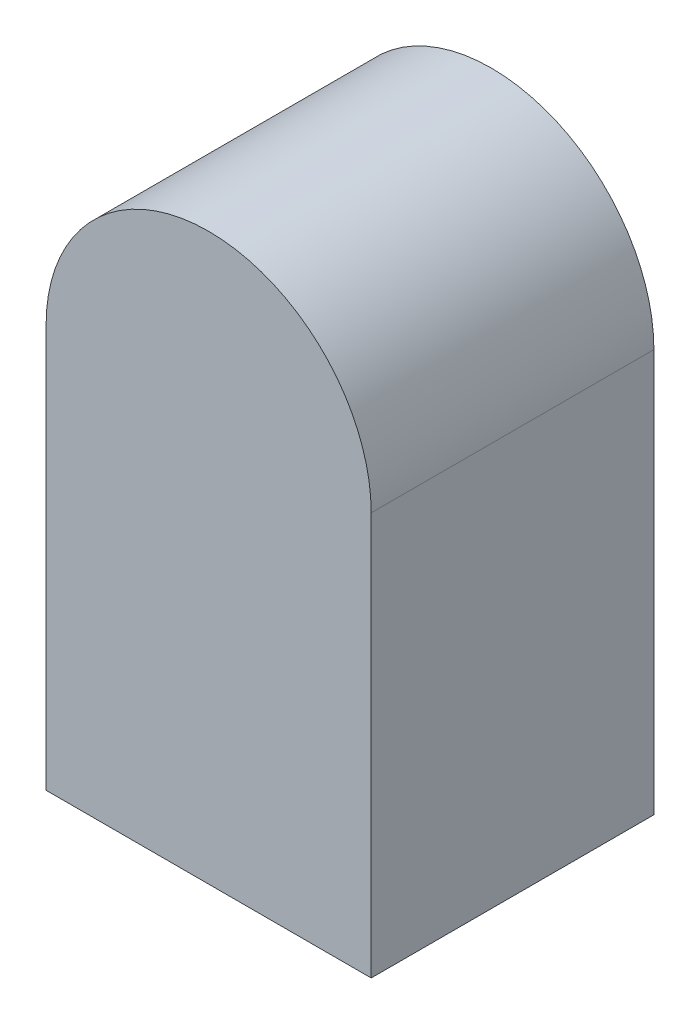
ISO-10303-21;
HEADER;
FILE_DESCRIPTION(('STEP AP214'),'2;1');
FILE_NAME('part.step','',(''),(''),'','','');
FILE_SCHEMA(('AUTOMOTIVE_DESIGN { 1 0 10303 214 1 1 1 1 }'));
ENDSEC;
DATA;
#1=APPLICATION_CONTEXT('core data for automotive mechanical design processes');
#2=APPLICATION_PROTOCOL_DEFINITION('international standard','automotive_design',2000,#1);
#3=PRODUCT_CONTEXT('',#1,'mechanical');
#4=PRODUCT('Part','Part','',(#3));
#5=PRODUCT_RELATED_PRODUCT_CATEGORY('part','',(#4));
#6=PRODUCT_DEFINITION_FORMATION('','',#4);
#7=PRODUCT_DEFINITION_CONTEXT('part definition',#1,'design');
#8=PRODUCT_DEFINITION('design','',#6,#7);
#9=PRODUCT_DEFINITION_SHAPE('','',#8);
#10=(LENGTH_UNIT() NAMED_UNIT(*) SI_UNIT(.MILLI.,.METRE.));
#11=(NAMED_UNIT(*) PLANE_ANGLE_UNIT() SI_UNIT($,.RADIAN.));
#12=(NAMED_UNIT(*) SI_UNIT($,.STERADIAN.) SOLID_ANGLE_UNIT());
#13=UNCERTAINTY_MEASURE_WITH_UNIT(LENGTH_MEASURE(1.E-05),#10,'distance_accuracy_value','');
#14=(GEOMETRIC_REPRESENTATION_CONTEXT(3) GLOBAL_UNCERTAINTY_ASSIGNED_CONTEXT((#13)) GLOBAL_UNIT_ASSIGNED_CONTEXT((#10,
#11,#12)) REPRESENTATION_CONTEXT('',''));
#15=CARTESIAN_POINT('',(0.,0.,0.));
#16=DIRECTION('',(0.,0.,1.));
#17=DIRECTION('',(1.,0.,0.));
#18=AXIS2_PLACEMENT_3D('',#15,#16,#17);
#19=CARTESIAN_POINT('',(-1.25,-2.8335265642716,0.));
#20=DIRECTION('',(0.,0.,1.));
#21=DIRECTION('',(0.,1.,0.));
#22=AXIS2_PLACEMENT_3D('',#19,#20,#21);
#23=PLANE('',#22);
#24=DIRECTION('',(1.,0.,0.));
#25=VECTOR('',#24,1.);
#26=CARTESIAN_POINT('',(-1.365,-3.,0.));
#27=LINE('',#26,#25);
#28=CARTESIAN_POINT('',(-1.365,-3.,0.));
#29=VERTEX_POINT('',#28);
#30=CARTESIAN_POINT('',(-1.135,-3.,0.));
#31=VERTEX_POINT('',#30);
#32=EDGE_CURVE('E11',#29,#31,#27,.T.);
#33=ORIENTED_EDGE('',*,*,#32,.F.);
#34=DIRECTION('',(0.,-1.,0.));
#35=VECTOR('',#34,1.);
#36=CARTESIAN_POINT('',(-1.365,-2.715,0.));
#37=LINE('',#36,#35);
#38=CARTESIAN_POINT('',(-1.365,-2.715,0.));
#39=VERTEX_POINT('',#38);
#40=EDGE_CURVE('E24',#39,#29,#37,.T.);
#41=ORIENTED_EDGE('',*,*,#40,.F.);
#42=CARTESIAN_POINT('',(-1.25,-2.715,0.));
#43=DIRECTION('',(0.,0.,1.));
#44=DIRECTION('',(1.,0.,0.));
#45=AXIS2_PLACEMENT_3D('',#42,#43,#44);
#46=CIRCLE('',#45,0.115);
#47=CARTESIAN_POINT('',(-1.135,-2.715,0.));
#48=VERTEX_POINT('',#47);
#49=EDGE_CURVE('E85',#48,#39,#46,.T.);
#50=ORIENTED_EDGE('',*,*,#49,.F.);
#51=DIRECTION('',(0.,1.,0.));
#52=VECTOR('',#51,1.);
#53=CARTESIAN_POINT('',(-1.135,-3.,0.));
#54=LINE('',#53,#52);
#55=EDGE_CURVE('E82',#31,#48,#54,.T.);
#56=ORIENTED_EDGE('',*,*,#55,.F.);
#57=EDGE_LOOP('',(#33,#41,#50,#56));
#58=FACE_BOUND('',#57,.T.);
#59=ADVANCED_FACE('F17',(#58),#23,.F.);
#60=CARTESIAN_POINT('',(-1.135,-3.,0.));
#61=DIRECTION('',(1.,0.,0.));
#62=DIRECTION('',(0.,1.,0.));
#63=AXIS2_PLACEMENT_3D('',#60,#61,#62);
#64=PLANE('',#63);
#65=ORIENTED_EDGE('',*,*,#55,.T.);
#66=DIRECTION('',(0.,0.,1.));
#67=VECTOR('',#66,1.);
#68=CARTESIAN_POINT('',(-1.135,-2.715,0.));
#69=LINE('',#68,#67);
#70=CARTESIAN_POINT('',(-1.135,-2.715,0.2));
#71=VERTEX_POINT('',#70);
#72=EDGE_CURVE('E80',#48,#71,#69,.T.);
#73=ORIENTED_EDGE('',*,*,#72,.T.);
#74=DIRECTION('',(0.,1.,0.));
#75=VECTOR('',#74,1.);
#76=CARTESIAN_POINT('',(-1.135,-3.,0.2));
#77=LINE('',#76,#75);
#78=CARTESIAN_POINT('',(-1.135,-3.,0.2));
#79=VERTEX_POINT('',#78);
#80=EDGE_CURVE('E78',#79,#71,#77,.T.);
#81=ORIENTED_EDGE('',*,*,#80,.F.);
#82=DIRECTION('',(0.,0.,-1.));
#83=VECTOR('',#82,1.);
#84=CARTESIAN_POINT('',(-1.135,-3.,0.));
#85=LINE('',#84,#83);
#86=EDGE_CURVE('E71',#79,#31,#85,.T.);
#87=ORIENTED_EDGE('',*,*,#86,.T.);
#88=EDGE_LOOP('',(#65,#73,#81,#87));
#89=FACE_BOUND('',#88,.T.);
#90=ADVANCED_FACE('F91',(#89),#64,.T.);
#91=CARTESIAN_POINT('',(-1.25,-2.715,0.));
#92=DIRECTION('',(0.,0.,1.));
#93=DIRECTION('',(1.,0.,0.));
#94=AXIS2_PLACEMENT_3D('',#91,#92,#93);
#95=CYLINDRICAL_SURFACE('',#94,0.115);
#96=ORIENTED_EDGE('',*,*,#49,.T.);
#97=DIRECTION('',(0.,0.,1.));
#98=VECTOR('',#97,1.);
#99=CARTESIAN_POINT('',(-1.365,-2.715,0.));
#100=LINE('',#99,#98);
#101=CARTESIAN_POINT('',(-1.365,-2.715,0.2));
#102=VERTEX_POINT('',#101);
#103=EDGE_CURVE('E75',#39,#102,#100,.T.);
#104=ORIENTED_EDGE('',*,*,#103,.T.);
#105=CARTESIAN_POINT('',(-1.25,-2.715,0.2));
#106=DIRECTION('',(0.,0.,1.));
#107=DIRECTION('',(1.,0.,0.));
#108=AXIS2_PLACEMENT_3D('',#105,#106,#107);
#109=CIRCLE('',#108,0.115);
#110=EDGE_CURVE('E59',#71,#102,#109,.T.);
#111=ORIENTED_EDGE('',*,*,#110,.F.);
#112=ORIENTED_EDGE('',*,*,#72,.F.);
#113=EDGE_LOOP('',(#96,#104,#111,#112));
#114=FACE_BOUND('',#113,.T.);
#115=ADVANCED_FACE('F89',(#114),#95,.T.);
#116=CARTESIAN_POINT('',(-1.365,-2.715,0.));
#117=DIRECTION('',(-1.,0.,0.));
#118=DIRECTION('',(0.,-1.,0.));
#119=AXIS2_PLACEMENT_3D('',#116,#117,#118);
#120=PLANE('',#119);
#121=ORIENTED_EDGE('',*,*,#40,.T.);
#122=DIRECTION('',(0.,0.,1.));
#123=VECTOR('',#122,1.);
#124=CARTESIAN_POINT('',(-1.365,-3.,0.));
#125=LINE('',#124,#123);
#126=CARTESIAN_POINT('',(-1.365,-3.,0.2));
#127=VERTEX_POINT('',#126);
#128=EDGE_CURVE('E53',#29,#127,#125,.T.);
#129=ORIENTED_EDGE('',*,*,#128,.T.);
#130=DIRECTION('',(0.,-1.,0.));
#131=VECTOR('',#130,1.);
#132=CARTESIAN_POINT('',(-1.365,-2.715,0.2));
#133=LINE('',#132,#131);
#134=EDGE_CURVE('E57',#102,#127,#133,.T.);
#135=ORIENTED_EDGE('',*,*,#134,.F.);
#136=ORIENTED_EDGE('',*,*,#103,.F.);
#137=EDGE_LOOP('',(#121,#129,#135,#136));
#138=FACE_BOUND('',#137,.T.);
#139=ADVANCED_FACE('F55',(#138),#120,.T.);
#140=CARTESIAN_POINT('',(-3.,-3.,0.));
#141=DIRECTION('',(0.,-1.,0.));
#142=DIRECTION('',(1.,0.,0.));
#143=AXIS2_PLACEMENT_3D('',#140,#141,#142);
#144=PLANE('',#143);
#145=ORIENTED_EDGE('',*,*,#86,.F.);
#146=DIRECTION('',(1.,0.,0.));
#147=VECTOR('',#146,1.);
#148=CARTESIAN_POINT('',(-2.125,-3.,0.2));
#149=LINE('',#148,#147);
#150=EDGE_CURVE('E66',#127,#79,#149,.T.);
#151=ORIENTED_EDGE('',*,*,#150,.F.);
#152=ORIENTED_EDGE('',*,*,#128,.F.);
#153=ORIENTED_EDGE('',*,*,#32,.T.);
#154=EDGE_LOOP('',(#145,#151,#152,#153));
#155=FACE_BOUND('',#154,.T.);
#156=ADVANCED_FACE('F69',(#155),#144,.T.);
#157=CARTESIAN_POINT('',(-1.25,-2.8335240809167,0.2));
#158=DIRECTION('',(0.,0.,1.));
#159=DIRECTION('',(1.,0.,0.));
#160=AXIS2_PLACEMENT_3D('',#157,#158,#159);
#161=PLANE('',#160);
#162=ORIENTED_EDGE('',*,*,#134,.T.);
#163=ORIENTED_EDGE('',*,*,#150,.T.);
#164=ORIENTED_EDGE('',*,*,#80,.T.);
#165=ORIENTED_EDGE('',*,*,#110,.T.);
#166=EDGE_LOOP('',(#162,#163,#164,#165));
#167=FACE_BOUND('',#166,.T.);
#168=ADVANCED_FACE('F64',(#167),#161,.T.);
#169=CLOSED_SHELL('',(#59,#90,#115,#139,#156,#168));
#170=MANIFOLD_SOLID_BREP('B1',#169);
#171=ADVANCED_BREP_SHAPE_REPRESENTATION('',(#18,#170),#14);
#172=SHAPE_DEFINITION_REPRESENTATION(#9,#171);
ENDSEC;
END-ISO-10303-21;
